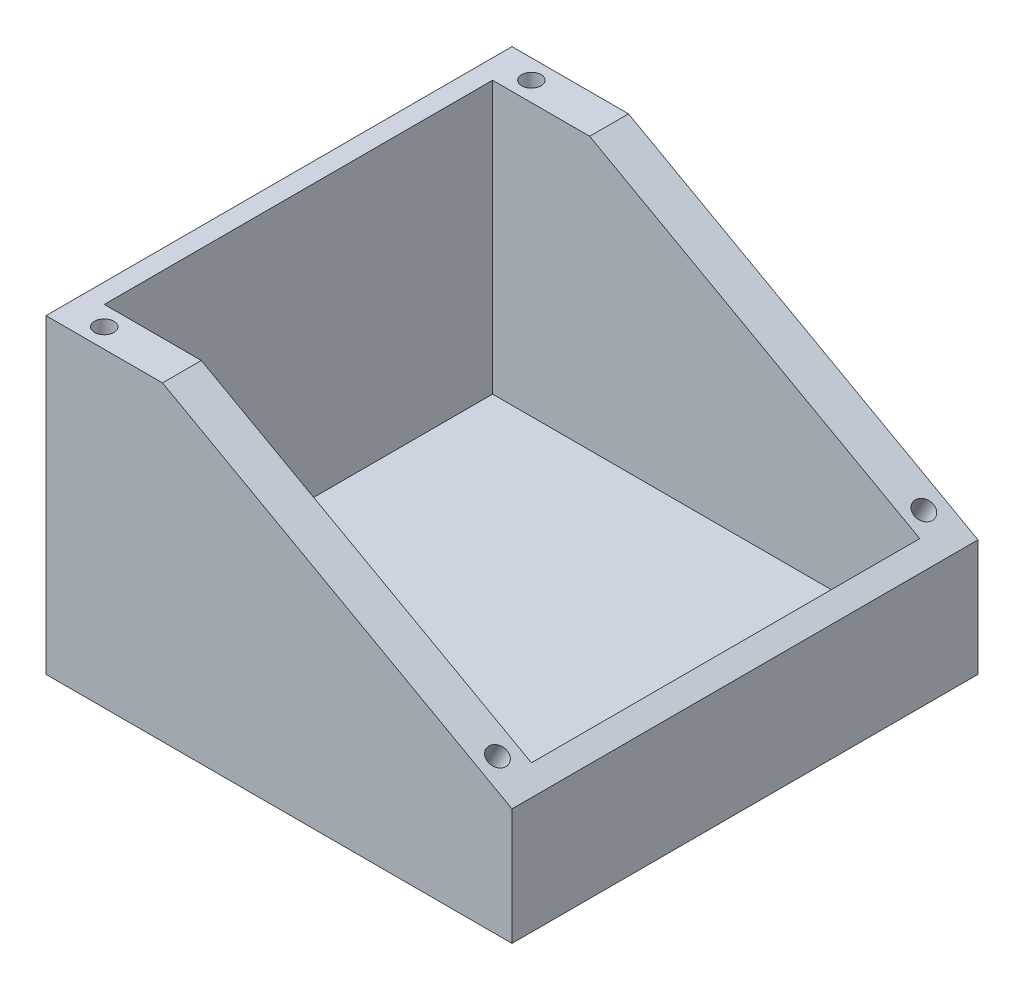
ISO-10303-21;
HEADER;
FILE_DESCRIPTION(('STEP AP214'),'2;1');
FILE_NAME('part.step','',(''),(''),'','','');
FILE_SCHEMA(('AUTOMOTIVE_DESIGN { 1 0 10303 214 1 1 1 1 }'));
ENDSEC;
DATA;
#1=APPLICATION_CONTEXT('core data for automotive mechanical design processes');
#2=APPLICATION_PROTOCOL_DEFINITION('international standard','automotive_design',2000,#1);
#3=PRODUCT_CONTEXT('',#1,'mechanical');
#4=PRODUCT('Part','Part','',(#3));
#5=PRODUCT_RELATED_PRODUCT_CATEGORY('part','',(#4));
#6=PRODUCT_DEFINITION_FORMATION('','',#4);
#7=PRODUCT_DEFINITION_CONTEXT('part definition',#1,'design');
#8=PRODUCT_DEFINITION('design','',#6,#7);
#9=PRODUCT_DEFINITION_SHAPE('','',#8);
#10=(LENGTH_UNIT() NAMED_UNIT(*) SI_UNIT(.MILLI.,.METRE.));
#11=(NAMED_UNIT(*) PLANE_ANGLE_UNIT() SI_UNIT($,.RADIAN.));
#12=(NAMED_UNIT(*) SI_UNIT($,.STERADIAN.) SOLID_ANGLE_UNIT());
#13=UNCERTAINTY_MEASURE_WITH_UNIT(LENGTH_MEASURE(1.E-05),#10,'distance_accuracy_value','');
#14=(GEOMETRIC_REPRESENTATION_CONTEXT(3) GLOBAL_UNCERTAINTY_ASSIGNED_CONTEXT((#13)) GLOBAL_UNIT_ASSIGNED_CONTEXT((#10,
#11,#12)) REPRESENTATION_CONTEXT('',''));
#15=CARTESIAN_POINT('',(0.,0.,0.));
#16=DIRECTION('',(0.,0.,1.));
#17=DIRECTION('',(1.,0.,0.));
#18=AXIS2_PLACEMENT_3D('',#15,#16,#17);
#19=CARTESIAN_POINT('',(152.4,101.6,152.4));
#20=DIRECTION('',(-1.,0.,0.));
#21=DIRECTION('',(0.,0.,1.));
#22=AXIS2_PLACEMENT_3D('',#19,#20,#21);
#23=PLANE('',#22);
#24=DIRECTION('',(0.,0.,1.));
#25=VECTOR('',#24,1.);
#26=CARTESIAN_POINT('',(152.4,38.1,0.));
#27=LINE('',#26,#25);
#28=CARTESIAN_POINT('',(152.4,38.1,0.));
#29=VERTEX_POINT('',#28);
#30=CARTESIAN_POINT('',(152.4,38.1,152.4));
#31=VERTEX_POINT('',#30);
#32=EDGE_CURVE('E56',#29,#31,#27,.T.);
#33=ORIENTED_EDGE('',*,*,#32,.T.);
#34=DIRECTION('',(0.,1.,0.));
#35=VECTOR('',#34,1.);
#36=CARTESIAN_POINT('',(152.4,101.6,152.4));
#37=LINE('',#36,#35);
#38=CARTESIAN_POINT('',(152.4,0.,152.4));
#39=VERTEX_POINT('',#38);
#40=EDGE_CURVE('E166',#39,#31,#37,.T.);
#41=ORIENTED_EDGE('',*,*,#40,.F.);
#42=DIRECTION('',(0.,0.,-1.));
#43=VECTOR('',#42,1.);
#44=CARTESIAN_POINT('',(152.4,0.,152.4));
#45=LINE('',#44,#43);
#46=CARTESIAN_POINT('',(152.4,0.,0.));
#47=VERTEX_POINT('',#46);
#48=EDGE_CURVE('E188',#39,#47,#45,.T.);
#49=ORIENTED_EDGE('',*,*,#48,.T.);
#50=DIRECTION('',(0.,1.,0.));
#51=VECTOR('',#50,1.);
#52=CARTESIAN_POINT('',(152.4,101.6,0.));
#53=LINE('',#52,#51);
#54=EDGE_CURVE('E177',#47,#29,#53,.T.);
#55=ORIENTED_EDGE('',*,*,#54,.T.);
#56=EDGE_LOOP('',(#33,#41,#49,#55));
#57=FACE_BOUND('',#56,.T.);
#58=ADVANCED_FACE('F33',(#57),#23,.F.);
#59=CARTESIAN_POINT('',(0.,101.6,152.4));
#60=DIRECTION('',(0.,-1.,0.));
#61=DIRECTION('',(0.,0.,-1.));
#62=AXIS2_PLACEMENT_3D('',#59,#60,#61);
#63=PLANE('',#62);
#64=CARTESIAN_POINT('',(12.7,101.6,146.05));
#65=DIRECTION('',(0.,1.,0.));
#66=DIRECTION('',(0.,0.,1.));
#67=AXIS2_PLACEMENT_3D('',#64,#65,#66);
#68=CIRCLE('',#67,3.175);
#69=CARTESIAN_POINT('',(12.7,101.6,149.225));
#70=VERTEX_POINT('',#69);
#71=EDGE_CURVE('E385',#70,#70,#68,.T.);
#72=ORIENTED_EDGE('',*,*,#71,.F.);
#73=EDGE_LOOP('',(#72));
#74=FACE_BOUND('',#73,.T.);
#75=CARTESIAN_POINT('',(12.7,101.6,6.34999999999999));
#76=DIRECTION('',(0.,1.,0.));
#77=DIRECTION('',(0.,0.,1.));
#78=AXIS2_PLACEMENT_3D('',#75,#76,#77);
#79=CIRCLE('',#78,3.175);
#80=CARTESIAN_POINT('',(12.7,101.6,9.525));
#81=VERTEX_POINT('',#80);
#82=EDGE_CURVE('E138',#81,#81,#79,.T.);
#83=ORIENTED_EDGE('',*,*,#82,.F.);
#84=EDGE_LOOP('',(#83));
#85=FACE_BOUND('',#84,.T.);
#86=DIRECTION('',(0.,0.,1.));
#87=VECTOR('',#86,1.);
#88=CARTESIAN_POINT('',(6.34999999999999,101.6,12.7));
#89=LINE('',#88,#87);
#90=CARTESIAN_POINT('',(6.34999999999999,101.6,12.7));
#91=VERTEX_POINT('',#90);
#92=CARTESIAN_POINT('',(6.35000000000002,101.6,139.7));
#93=VERTEX_POINT('',#92);
#94=EDGE_CURVE('E135',#91,#93,#89,.T.);
#95=ORIENTED_EDGE('',*,*,#94,.F.);
#96=DIRECTION('',(-1.,0.,0.));
#97=VECTOR('',#96,1.);
#98=CARTESIAN_POINT('',(146.05,101.6,12.7));
#99=LINE('',#98,#97);
#100=CARTESIAN_POINT('',(38.1000000000001,101.6,12.7));
#101=VERTEX_POINT('',#100);
#102=EDGE_CURVE('E117',#101,#91,#99,.T.);
#103=ORIENTED_EDGE('',*,*,#102,.F.);
#104=DIRECTION('',(0.,0.,1.));
#105=VECTOR('',#104,1.);
#106=CARTESIAN_POINT('',(38.1,101.6,0.));
#107=LINE('',#106,#105);
#108=CARTESIAN_POINT('',(38.1,101.6,0.));
#109=VERTEX_POINT('',#108);
#110=EDGE_CURVE('E157',#109,#101,#107,.T.);
#111=ORIENTED_EDGE('',*,*,#110,.F.);
#112=DIRECTION('',(-1.,0.,0.));
#113=VECTOR('',#112,1.);
#114=CARTESIAN_POINT('',(0.,101.6,0.));
#115=LINE('',#114,#113);
#116=CARTESIAN_POINT('',(0.,101.6,0.));
#117=VERTEX_POINT('',#116);
#118=EDGE_CURVE('E180',#109,#117,#115,.T.);
#119=ORIENTED_EDGE('',*,*,#118,.T.);
#120=DIRECTION('',(0.,0.,-1.));
#121=VECTOR('',#120,1.);
#122=CARTESIAN_POINT('',(0.,101.6,152.4));
#123=LINE('',#122,#121);
#124=CARTESIAN_POINT('',(0.,101.6,152.4));
#125=VERTEX_POINT('',#124);
#126=EDGE_CURVE('E185',#125,#117,#123,.T.);
#127=ORIENTED_EDGE('',*,*,#126,.F.);
#128=DIRECTION('',(-1.,0.,0.));
#129=VECTOR('',#128,1.);
#130=CARTESIAN_POINT('',(0.,101.6,152.4));
#131=LINE('',#130,#129);
#132=CARTESIAN_POINT('',(38.1,101.6,152.4));
#133=VERTEX_POINT('',#132);
#134=EDGE_CURVE('E170',#133,#125,#131,.T.);
#135=ORIENTED_EDGE('',*,*,#134,.F.);
#136=CARTESIAN_POINT('',(38.1,101.6,139.7));
#137=VERTEX_POINT('',#136);
#138=EDGE_CURVE('E161',#137,#133,#107,.T.);
#139=ORIENTED_EDGE('',*,*,#138,.F.);
#140=DIRECTION('',(1.,0.,0.));
#141=VECTOR('',#140,1.);
#142=CARTESIAN_POINT('',(6.35000000000002,101.6,139.7));
#143=LINE('',#142,#141);
#144=EDGE_CURVE('E48',#93,#137,#143,.T.);
#145=ORIENTED_EDGE('',*,*,#144,.F.);
#146=EDGE_LOOP('',(#95,#103,#111,#119,#127,#135,#139,#145));
#147=FACE_BOUND('',#146,.T.);
#148=ADVANCED_FACE('F200',(#74,#85,#147),#63,.F.);
#149=CARTESIAN_POINT('',(0.,0.,152.4));
#150=DIRECTION('',(0.,0.,-1.));
#151=DIRECTION('',(-1.,0.,0.));
#152=AXIS2_PLACEMENT_3D('',#149,#150,#151);
#153=PLANE('',#152);
#154=DIRECTION('',(-0.874157276121538,0.485642931178632,0.));
#155=VECTOR('',#154,1.);
#156=CARTESIAN_POINT('',(52.1179245283019,93.8122641509434,152.4));
#157=LINE('',#156,#155);
#158=EDGE_CURVE('E148',#31,#133,#157,.T.);
#159=ORIENTED_EDGE('',*,*,#158,.T.);
#160=ORIENTED_EDGE('',*,*,#134,.T.);
#161=DIRECTION('',(0.,-1.,0.));
#162=VECTOR('',#161,1.);
#163=CARTESIAN_POINT('',(0.,0.,152.4));
#164=LINE('',#163,#162);
#165=CARTESIAN_POINT('',(0.,0.,152.4));
#166=VERTEX_POINT('',#165);
#167=EDGE_CURVE('E172',#125,#166,#164,.T.);
#168=ORIENTED_EDGE('',*,*,#167,.T.);
#169=DIRECTION('',(1.,0.,0.));
#170=VECTOR('',#169,1.);
#171=CARTESIAN_POINT('',(152.4,0.,152.4));
#172=LINE('',#171,#170);
#173=EDGE_CURVE('E163',#166,#39,#172,.T.);
#174=ORIENTED_EDGE('',*,*,#173,.T.);
#175=ORIENTED_EDGE('',*,*,#40,.T.);
#176=EDGE_LOOP('',(#159,#160,#168,#174,#175));
#177=FACE_BOUND('',#176,.T.);
#178=ADVANCED_FACE('F214',(#177),#153,.F.);
#179=CARTESIAN_POINT('',(0.,0.,0.));
#180=DIRECTION('',(0.,0.,-1.));
#181=DIRECTION('',(-1.,0.,0.));
#182=AXIS2_PLACEMENT_3D('',#179,#180,#181);
#183=PLANE('',#182);
#184=ORIENTED_EDGE('',*,*,#118,.F.);
#185=DIRECTION('',(-0.874157276121538,0.485642931178632,0.));
#186=VECTOR('',#185,1.);
#187=CARTESIAN_POINT('',(52.1179245283019,93.8122641509434,0.));
#188=LINE('',#187,#186);
#189=EDGE_CURVE('E153',#29,#109,#188,.T.);
#190=ORIENTED_EDGE('',*,*,#189,.F.);
#191=ORIENTED_EDGE('',*,*,#54,.F.);
#192=DIRECTION('',(1.,0.,0.));
#193=VECTOR('',#192,1.);
#194=CARTESIAN_POINT('',(152.4,0.,0.));
#195=LINE('',#194,#193);
#196=CARTESIAN_POINT('',(0.,0.,0.));
#197=VERTEX_POINT('',#196);
#198=EDGE_CURVE('E160',#197,#47,#195,.T.);
#199=ORIENTED_EDGE('',*,*,#198,.F.);
#200=DIRECTION('',(0.,-1.,0.));
#201=VECTOR('',#200,1.);
#202=CARTESIAN_POINT('',(0.,0.,0.));
#203=LINE('',#202,#201);
#204=EDGE_CURVE('E167',#117,#197,#203,.T.);
#205=ORIENTED_EDGE('',*,*,#204,.F.);
#206=EDGE_LOOP('',(#184,#190,#191,#199,#205));
#207=FACE_BOUND('',#206,.T.);
#208=ADVANCED_FACE('F204',(#207),#183,.T.);
#209=CARTESIAN_POINT('',(152.4,0.,152.4));
#210=DIRECTION('',(0.,1.,0.));
#211=DIRECTION('',(-1.,0.,0.));
#212=AXIS2_PLACEMENT_3D('',#209,#210,#211);
#213=PLANE('',#212);
#214=ORIENTED_EDGE('',*,*,#198,.T.);
#215=ORIENTED_EDGE('',*,*,#48,.F.);
#216=ORIENTED_EDGE('',*,*,#173,.F.);
#217=DIRECTION('',(0.,0.,-1.));
#218=VECTOR('',#217,1.);
#219=CARTESIAN_POINT('',(0.,0.,152.4));
#220=LINE('',#219,#218);
#221=EDGE_CURVE('E174',#166,#197,#220,.T.);
#222=ORIENTED_EDGE('',*,*,#221,.T.);
#223=EDGE_LOOP('',(#214,#215,#216,#222));
#224=FACE_BOUND('',#223,.T.);
#225=ADVANCED_FACE('F35',(#224),#213,.F.);
#226=CARTESIAN_POINT('',(0.,0.,152.4));
#227=DIRECTION('',(1.,0.,0.));
#228=DIRECTION('',(0.,0.,-1.));
#229=AXIS2_PLACEMENT_3D('',#226,#227,#228);
#230=PLANE('',#229);
#231=ORIENTED_EDGE('',*,*,#204,.T.);
#232=ORIENTED_EDGE('',*,*,#221,.F.);
#233=ORIENTED_EDGE('',*,*,#167,.F.);
#234=ORIENTED_EDGE('',*,*,#126,.T.);
#235=EDGE_LOOP('',(#231,#232,#233,#234));
#236=FACE_BOUND('',#235,.T.);
#237=ADVANCED_FACE('F208',(#236),#230,.F.);
#238=CARTESIAN_POINT('',(52.1179245283019,93.8122641509434,0.));
#239=DIRECTION('',(0.485642931178632,0.874157276121538,0.));
#240=DIRECTION('',(-0.874157276121538,0.485642931178632,0.));
#241=AXIS2_PLACEMENT_3D('',#238,#239,#240);
#242=PLANE('',#241);
#243=CARTESIAN_POINT('',(141.298202593256,44.2676652259686,146.05));
#244=DIRECTION('',(0.485642931178632,0.874157276121538,0.));
#245=DIRECTION('',(-0.874157276121538,0.485642931178632,0.));
#246=AXIS2_PLACEMENT_3D('',#243,#244,#245);
#247=CIRCLE('',#246,3.17499999999999);
#248=CARTESIAN_POINT('',(138.522753241571,45.8095815324608,146.05));
#249=VERTEX_POINT('',#248);
#250=EDGE_CURVE('E370',#249,#249,#247,.T.);
#251=ORIENTED_EDGE('',*,*,#250,.F.);
#252=EDGE_LOOP('',(#251));
#253=FACE_BOUND('',#252,.T.);
#254=CARTESIAN_POINT('',(141.298202593256,44.2676652259686,6.604));
#255=DIRECTION('',(0.485642931178632,0.874157276121538,0.));
#256=DIRECTION('',(-0.874157276121538,0.485642931178632,0.));
#257=AXIS2_PLACEMENT_3D('',#254,#255,#256);
#258=CIRCLE('',#257,3.17499999999999);
#259=CARTESIAN_POINT('',(138.522753241571,45.8095815324608,6.604));
#260=VERTEX_POINT('',#259);
#261=EDGE_CURVE('E380',#260,#260,#258,.T.);
#262=ORIENTED_EDGE('',*,*,#261,.F.);
#263=EDGE_LOOP('',(#262));
#264=FACE_BOUND('',#263,.T.);
#265=DIRECTION('',(-0.874157276121538,0.485642931178632,0.));
#266=VECTOR('',#265,1.);
#267=CARTESIAN_POINT('',(52.1179245283019,93.8122641509434,12.7));
#268=LINE('',#267,#266);
#269=CARTESIAN_POINT('',(146.05,41.6277777777778,12.7));
#270=VERTEX_POINT('',#269);
#271=EDGE_CURVE('E11',#270,#101,#268,.T.);
#272=ORIENTED_EDGE('',*,*,#271,.F.);
#273=DIRECTION('',(0.,0.,-1.));
#274=VECTOR('',#273,1.);
#275=CARTESIAN_POINT('',(146.05,41.6277777777778,0.));
#276=LINE('',#275,#274);
#277=CARTESIAN_POINT('',(146.05,41.6277777777778,139.7));
#278=VERTEX_POINT('',#277);
#279=EDGE_CURVE('E41',#278,#270,#276,.T.);
#280=ORIENTED_EDGE('',*,*,#279,.F.);
#281=DIRECTION('',(0.874157276121538,-0.485642931178632,0.));
#282=VECTOR('',#281,1.);
#283=CARTESIAN_POINT('',(52.1179245283019,93.8122641509434,139.7));
#284=LINE('',#283,#282);
#285=EDGE_CURVE('E191',#137,#278,#284,.T.);
#286=ORIENTED_EDGE('',*,*,#285,.F.);
#287=ORIENTED_EDGE('',*,*,#138,.T.);
#288=ORIENTED_EDGE('',*,*,#158,.F.);
#289=ORIENTED_EDGE('',*,*,#32,.F.);
#290=ORIENTED_EDGE('',*,*,#189,.T.);
#291=ORIENTED_EDGE('',*,*,#110,.T.);
#292=EDGE_LOOP('',(#272,#280,#286,#287,#288,#289,#290,#291));
#293=FACE_BOUND('',#292,.T.);
#294=ADVANCED_FACE('F196',(#253,#264,#293),#242,.T.);
#295=CARTESIAN_POINT('',(146.05,12.7,12.7));
#296=DIRECTION('',(0.,0.,-1.));
#297=DIRECTION('',(-1.,0.,0.));
#298=AXIS2_PLACEMENT_3D('',#295,#296,#297);
#299=PLANE('',#298);
#300=ORIENTED_EDGE('',*,*,#271,.T.);
#301=ORIENTED_EDGE('',*,*,#102,.T.);
#302=DIRECTION('',(0.,1.,0.));
#303=VECTOR('',#302,1.);
#304=CARTESIAN_POINT('',(6.34999999999999,12.7,12.7));
#305=LINE('',#304,#303);
#306=CARTESIAN_POINT('',(6.34999999999999,12.7,12.7));
#307=VERTEX_POINT('',#306);
#308=EDGE_CURVE('E109',#307,#91,#305,.T.);
#309=ORIENTED_EDGE('',*,*,#308,.F.);
#310=DIRECTION('',(-1.,0.,0.));
#311=VECTOR('',#310,1.);
#312=CARTESIAN_POINT('',(146.05,12.7,12.7));
#313=LINE('',#312,#311);
#314=CARTESIAN_POINT('',(146.05,12.7,12.7));
#315=VERTEX_POINT('',#314);
#316=EDGE_CURVE('E114',#315,#307,#313,.T.);
#317=ORIENTED_EDGE('',*,*,#316,.F.);
#318=DIRECTION('',(0.,1.,0.));
#319=VECTOR('',#318,1.);
#320=CARTESIAN_POINT('',(146.05,12.7,12.7));
#321=LINE('',#320,#319);
#322=EDGE_CURVE('E146',#315,#270,#321,.T.);
#323=ORIENTED_EDGE('',*,*,#322,.T.);
#324=EDGE_LOOP('',(#300,#301,#309,#317,#323));
#325=FACE_BOUND('',#324,.T.);
#326=ADVANCED_FACE('F111',(#325),#299,.F.);
#327=CARTESIAN_POINT('',(146.05,12.7,139.7));
#328=DIRECTION('',(1.,0.,0.));
#329=DIRECTION('',(0.,0.,-1.));
#330=AXIS2_PLACEMENT_3D('',#327,#328,#329);
#331=PLANE('',#330);
#332=ORIENTED_EDGE('',*,*,#279,.T.);
#333=ORIENTED_EDGE('',*,*,#322,.F.);
#334=DIRECTION('',(0.,0.,-1.));
#335=VECTOR('',#334,1.);
#336=CARTESIAN_POINT('',(146.05,12.7,139.7));
#337=LINE('',#336,#335);
#338=CARTESIAN_POINT('',(146.05,12.7,139.7));
#339=VERTEX_POINT('',#338);
#340=EDGE_CURVE('E122',#339,#315,#337,.T.);
#341=ORIENTED_EDGE('',*,*,#340,.F.);
#342=DIRECTION('',(0.,1.,0.));
#343=VECTOR('',#342,1.);
#344=CARTESIAN_POINT('',(146.05,12.7,139.7));
#345=LINE('',#344,#343);
#346=EDGE_CURVE('E149',#339,#278,#345,.T.);
#347=ORIENTED_EDGE('',*,*,#346,.T.);
#348=EDGE_LOOP('',(#332,#333,#341,#347));
#349=FACE_BOUND('',#348,.T.);
#350=ADVANCED_FACE('F194',(#349),#331,.F.);
#351=CARTESIAN_POINT('',(6.35000000000002,12.7,139.7));
#352=DIRECTION('',(0.,0.,1.));
#353=DIRECTION('',(1.,0.,0.));
#354=AXIS2_PLACEMENT_3D('',#351,#352,#353);
#355=PLANE('',#354);
#356=ORIENTED_EDGE('',*,*,#285,.T.);
#357=ORIENTED_EDGE('',*,*,#346,.F.);
#358=DIRECTION('',(1.,0.,0.));
#359=VECTOR('',#358,1.);
#360=CARTESIAN_POINT('',(6.35000000000002,12.7,139.7));
#361=LINE('',#360,#359);
#362=CARTESIAN_POINT('',(6.35000000000002,12.7,139.7));
#363=VERTEX_POINT('',#362);
#364=EDGE_CURVE('E130',#363,#339,#361,.T.);
#365=ORIENTED_EDGE('',*,*,#364,.F.);
#366=DIRECTION('',(0.,1.,0.));
#367=VECTOR('',#366,1.);
#368=CARTESIAN_POINT('',(6.35000000000002,12.7,139.7));
#369=LINE('',#368,#367);
#370=EDGE_CURVE('E121',#363,#93,#369,.T.);
#371=ORIENTED_EDGE('',*,*,#370,.T.);
#372=ORIENTED_EDGE('',*,*,#144,.T.);
#373=EDGE_LOOP('',(#356,#357,#365,#371,#372));
#374=FACE_BOUND('',#373,.T.);
#375=ADVANCED_FACE('F217',(#374),#355,.F.);
#376=CARTESIAN_POINT('',(6.34999999999999,12.7,12.7));
#377=DIRECTION('',(-1.,0.,0.));
#378=DIRECTION('',(0.,0.,1.));
#379=AXIS2_PLACEMENT_3D('',#376,#377,#378);
#380=PLANE('',#379);
#381=ORIENTED_EDGE('',*,*,#94,.T.);
#382=ORIENTED_EDGE('',*,*,#370,.F.);
#383=DIRECTION('',(0.,0.,1.));
#384=VECTOR('',#383,1.);
#385=CARTESIAN_POINT('',(6.34999999999999,12.7,12.7));
#386=LINE('',#385,#384);
#387=EDGE_CURVE('E125',#307,#363,#386,.T.);
#388=ORIENTED_EDGE('',*,*,#387,.F.);
#389=ORIENTED_EDGE('',*,*,#308,.T.);
#390=EDGE_LOOP('',(#381,#382,#388,#389));
#391=FACE_BOUND('',#390,.T.);
#392=ADVANCED_FACE('F126',(#391),#380,.F.);
#393=CARTESIAN_POINT('',(0.,12.7,0.));
#394=DIRECTION('',(0.,1.,0.));
#395=DIRECTION('',(0.,0.,1.));
#396=AXIS2_PLACEMENT_3D('',#393,#394,#395);
#397=PLANE('',#396);
#398=ORIENTED_EDGE('',*,*,#316,.T.);
#399=ORIENTED_EDGE('',*,*,#387,.T.);
#400=ORIENTED_EDGE('',*,*,#364,.T.);
#401=ORIENTED_EDGE('',*,*,#340,.T.);
#402=EDGE_LOOP('',(#398,#399,#400,#401));
#403=FACE_BOUND('',#402,.T.);
#404=ADVANCED_FACE('F132',(#403),#397,.T.);
#405=CARTESIAN_POINT('',(12.7,88.9,6.34999999999999));
#406=DIRECTION('',(0.,1.,0.));
#407=DIRECTION('',(0.,0.,1.));
#408=AXIS2_PLACEMENT_3D('',#405,#406,#407);
#409=CYLINDRICAL_SURFACE('',#408,3.175);
#410=CARTESIAN_POINT('',(12.7,88.9,6.34999999999999));
#411=DIRECTION('',(0.,1.,0.));
#412=DIRECTION('',(0.,0.,1.));
#413=AXIS2_PLACEMENT_3D('',#410,#411,#412);
#414=CIRCLE('',#413,3.175);
#415=CARTESIAN_POINT('',(12.7,88.9,9.525));
#416=VERTEX_POINT('',#415);
#417=EDGE_CURVE('E373',#416,#416,#414,.T.);
#418=ORIENTED_EDGE('',*,*,#417,.F.);
#419=EDGE_LOOP('',(#418));
#420=FACE_BOUND('',#419,.T.);
#421=ORIENTED_EDGE('',*,*,#82,.T.);
#422=EDGE_LOOP('',(#421));
#423=FACE_BOUND('',#422,.T.);
#424=ADVANCED_FACE('F272',(#420,#423),#409,.F.);
#425=CARTESIAN_POINT('',(12.7,88.9,6.34999999999999));
#426=DIRECTION('',(0.,1.,0.));
#427=DIRECTION('',(0.,0.,1.));
#428=AXIS2_PLACEMENT_3D('',#425,#426,#427);
#429=PLANE('',#428);
#430=ORIENTED_EDGE('',*,*,#417,.T.);
#431=EDGE_LOOP('',(#430));
#432=FACE_BOUND('',#431,.T.);
#433=ADVANCED_FACE('F289',(#432),#429,.T.);
#434=CARTESIAN_POINT('',(12.7,88.9,146.05));
#435=DIRECTION('',(0.,1.,0.));
#436=DIRECTION('',(0.,0.,1.));
#437=AXIS2_PLACEMENT_3D('',#434,#435,#436);
#438=CYLINDRICAL_SURFACE('',#437,3.175);
#439=CARTESIAN_POINT('',(12.7,88.9,146.05));
#440=DIRECTION('',(0.,1.,0.));
#441=DIRECTION('',(0.,0.,1.));
#442=AXIS2_PLACEMENT_3D('',#439,#440,#441);
#443=CIRCLE('',#442,3.175);
#444=CARTESIAN_POINT('',(12.7,88.9,149.225));
#445=VERTEX_POINT('',#444);
#446=EDGE_CURVE('E144',#445,#445,#443,.T.);
#447=ORIENTED_EDGE('',*,*,#446,.F.);
#448=EDGE_LOOP('',(#447));
#449=FACE_BOUND('',#448,.T.);
#450=ORIENTED_EDGE('',*,*,#71,.T.);
#451=EDGE_LOOP('',(#450));
#452=FACE_BOUND('',#451,.T.);
#453=ADVANCED_FACE('F299',(#449,#452),#438,.F.);
#454=CARTESIAN_POINT('',(12.7,88.9,146.05));
#455=DIRECTION('',(0.,1.,0.));
#456=DIRECTION('',(0.,0.,1.));
#457=AXIS2_PLACEMENT_3D('',#454,#455,#456);
#458=PLANE('',#457);
#459=ORIENTED_EDGE('',*,*,#446,.T.);
#460=EDGE_LOOP('',(#459));
#461=FACE_BOUND('',#460,.T.);
#462=ADVANCED_FACE('F309',(#461),#458,.T.);
#463=CARTESIAN_POINT('',(135.130537367288,33.1658678192251,6.604));
#464=DIRECTION('',(0.485642931178632,0.874157276121538,0.));
#465=DIRECTION('',(-0.874157276121538,0.485642931178632,0.));
#466=AXIS2_PLACEMENT_3D('',#463,#464,#465);
#467=CYLINDRICAL_SURFACE('',#466,3.17499999999999);
#468=CARTESIAN_POINT('',(135.130537367288,33.1658678192251,6.604));
#469=DIRECTION('',(0.485642931178632,0.874157276121538,0.));
#470=DIRECTION('',(-0.874157276121538,0.485642931178632,0.));
#471=AXIS2_PLACEMENT_3D('',#468,#469,#470);
#472=CIRCLE('',#471,3.17499999999999);
#473=CARTESIAN_POINT('',(132.355088015602,34.7077841257173,6.604));
#474=VERTEX_POINT('',#473);
#475=EDGE_CURVE('E375',#474,#474,#472,.T.);
#476=ORIENTED_EDGE('',*,*,#475,.F.);
#477=EDGE_LOOP('',(#476));
#478=FACE_BOUND('',#477,.T.);
#479=ORIENTED_EDGE('',*,*,#261,.T.);
#480=EDGE_LOOP('',(#479));
#481=FACE_BOUND('',#480,.T.);
#482=ADVANCED_FACE('F318',(#478,#481),#467,.F.);
#483=CARTESIAN_POINT('',(135.130537367288,33.1658678192251,6.604));
#484=DIRECTION('',(0.485642931178632,0.874157276121538,0.));
#485=DIRECTION('',(-0.874157276121538,0.485642931178632,0.));
#486=AXIS2_PLACEMENT_3D('',#483,#484,#485);
#487=PLANE('',#486);
#488=ORIENTED_EDGE('',*,*,#475,.T.);
#489=EDGE_LOOP('',(#488));
#490=FACE_BOUND('',#489,.T.);
#491=ADVANCED_FACE('F333',(#490),#487,.T.);
#492=CARTESIAN_POINT('',(135.130537367288,33.1658678192251,146.05));
#493=DIRECTION('',(0.485642931178632,0.874157276121538,0.));
#494=DIRECTION('',(-0.874157276121538,0.485642931178632,0.));
#495=AXIS2_PLACEMENT_3D('',#492,#493,#494);
#496=CYLINDRICAL_SURFACE('',#495,3.17499999999999);
#497=CARTESIAN_POINT('',(135.130537367288,33.1658678192251,146.05));
#498=DIRECTION('',(0.485642931178632,0.874157276121538,0.));
#499=DIRECTION('',(-0.874157276121538,0.485642931178632,0.));
#500=AXIS2_PLACEMENT_3D('',#497,#498,#499);
#501=CIRCLE('',#500,3.17499999999999);
#502=CARTESIAN_POINT('',(132.355088015602,34.7077841257173,146.05));
#503=VERTEX_POINT('',#502);
#504=EDGE_CURVE('E369',#503,#503,#501,.T.);
#505=ORIENTED_EDGE('',*,*,#504,.F.);
#506=EDGE_LOOP('',(#505));
#507=FACE_BOUND('',#506,.T.);
#508=ORIENTED_EDGE('',*,*,#250,.T.);
#509=EDGE_LOOP('',(#508));
#510=FACE_BOUND('',#509,.T.);
#511=ADVANCED_FACE('F343',(#507,#510),#496,.F.);
#512=CARTESIAN_POINT('',(135.130537367288,33.1658678192251,146.05));
#513=DIRECTION('',(0.485642931178632,0.874157276121538,0.));
#514=DIRECTION('',(-0.874157276121538,0.485642931178632,0.));
#515=AXIS2_PLACEMENT_3D('',#512,#513,#514);
#516=PLANE('',#515);
#517=ORIENTED_EDGE('',*,*,#504,.T.);
#518=EDGE_LOOP('',(#517));
#519=FACE_BOUND('',#518,.T.);
#520=ADVANCED_FACE('F353',(#519),#516,.T.);
#521=CLOSED_SHELL('',(#58,#148,#178,#208,#225,#237,#294,#326,#350,#375,#392,#404,#424,#433,#453,
#462,#482,#491,#511,#520));
#522=MANIFOLD_SOLID_BREP('B2',#521);
#523=ADVANCED_BREP_SHAPE_REPRESENTATION('',(#18,#522),#14);
#524=SHAPE_DEFINITION_REPRESENTATION(#9,#523);
ENDSEC;
END-ISO-10303-21;
